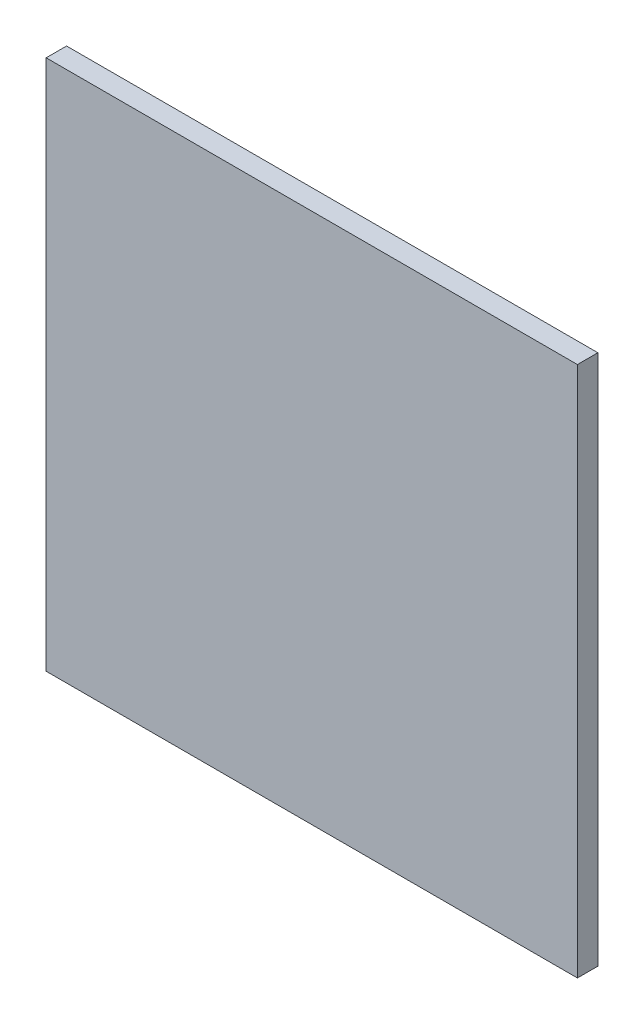
ISO-10303-21;
HEADER;
FILE_DESCRIPTION(('STEP AP214'),'2;1');
FILE_NAME('part.step','',(''),(''),'','','');
FILE_SCHEMA(('AUTOMOTIVE_DESIGN { 1 0 10303 214 1 1 1 1 }'));
ENDSEC;
DATA;
#1=APPLICATION_CONTEXT('core data for automotive mechanical design processes');
#2=APPLICATION_PROTOCOL_DEFINITION('international standard','automotive_design',2000,#1);
#3=PRODUCT_CONTEXT('',#1,'mechanical');
#4=PRODUCT('Part','Part','',(#3));
#5=PRODUCT_RELATED_PRODUCT_CATEGORY('part','',(#4));
#6=PRODUCT_DEFINITION_FORMATION('','',#4);
#7=PRODUCT_DEFINITION_CONTEXT('part definition',#1,'design');
#8=PRODUCT_DEFINITION('design','',#6,#7);
#9=PRODUCT_DEFINITION_SHAPE('','',#8);
#10=(LENGTH_UNIT() NAMED_UNIT(*) SI_UNIT(.MILLI.,.METRE.));
#11=(NAMED_UNIT(*) PLANE_ANGLE_UNIT() SI_UNIT($,.RADIAN.));
#12=(NAMED_UNIT(*) SI_UNIT($,.STERADIAN.) SOLID_ANGLE_UNIT());
#13=UNCERTAINTY_MEASURE_WITH_UNIT(LENGTH_MEASURE(1.E-05),#10,'distance_accuracy_value','');
#14=(GEOMETRIC_REPRESENTATION_CONTEXT(3) GLOBAL_UNCERTAINTY_ASSIGNED_CONTEXT((#13)) GLOBAL_UNIT_ASSIGNED_CONTEXT((#10,
#11,#12)) REPRESENTATION_CONTEXT('',''));
#15=CARTESIAN_POINT('',(0.,0.,0.));
#16=DIRECTION('',(0.,0.,1.));
#17=DIRECTION('',(1.,0.,0.));
#18=AXIS2_PLACEMENT_3D('',#15,#16,#17);
#19=CARTESIAN_POINT('',(-65.,-65.,5.));
#20=DIRECTION('',(1.,0.,0.));
#21=DIRECTION('',(0.,0.,-1.));
#22=AXIS2_PLACEMENT_3D('',#19,#20,#21);
#23=PLANE('',#22);
#24=DIRECTION('',(0.,-1.,0.));
#25=VECTOR('',#24,1.);
#26=CARTESIAN_POINT('',(-65.,-65.,0.));
#27=LINE('',#26,#25);
#28=CARTESIAN_POINT('',(-65.,65.,0.));
#29=VERTEX_POINT('',#28);
#30=CARTESIAN_POINT('',(-65.,-65.,0.));
#31=VERTEX_POINT('',#30);
#32=EDGE_CURVE('E98',#29,#31,#27,.T.);
#33=ORIENTED_EDGE('',*,*,#32,.T.);
#34=DIRECTION('',(0.,0.,-1.));
#35=VECTOR('',#34,1.);
#36=CARTESIAN_POINT('',(-65.,-65.,5.));
#37=LINE('',#36,#35);
#38=CARTESIAN_POINT('',(-65.,-65.,5.));
#39=VERTEX_POINT('',#38);
#40=EDGE_CURVE('E11',#39,#31,#37,.T.);
#41=ORIENTED_EDGE('',*,*,#40,.F.);
#42=DIRECTION('',(0.,-1.,0.));
#43=VECTOR('',#42,1.);
#44=CARTESIAN_POINT('',(-65.,-65.,5.));
#45=LINE('',#44,#43);
#46=CARTESIAN_POINT('',(-65.,65.,5.));
#47=VERTEX_POINT('',#46);
#48=EDGE_CURVE('E86',#47,#39,#45,.T.);
#49=ORIENTED_EDGE('',*,*,#48,.F.);
#50=DIRECTION('',(0.,0.,-1.));
#51=VECTOR('',#50,1.);
#52=CARTESIAN_POINT('',(-65.,65.,5.));
#53=LINE('',#52,#51);
#54=EDGE_CURVE('E94',#47,#29,#53,.T.);
#55=ORIENTED_EDGE('',*,*,#54,.T.);
#56=EDGE_LOOP('',(#33,#41,#49,#55));
#57=FACE_BOUND('',#56,.T.);
#58=ADVANCED_FACE('F35',(#57),#23,.F.);
#59=CARTESIAN_POINT('',(65.,-65.,5.));
#60=DIRECTION('',(0.,1.,0.));
#61=DIRECTION('',(-1.,0.,0.));
#62=AXIS2_PLACEMENT_3D('',#59,#60,#61);
#63=PLANE('',#62);
#64=DIRECTION('',(1.,0.,0.));
#65=VECTOR('',#64,1.);
#66=CARTESIAN_POINT('',(65.,-65.,0.));
#67=LINE('',#66,#65);
#68=CARTESIAN_POINT('',(65.,-65.,0.));
#69=VERTEX_POINT('',#68);
#70=EDGE_CURVE('E90',#31,#69,#67,.T.);
#71=ORIENTED_EDGE('',*,*,#70,.T.);
#72=DIRECTION('',(0.,0.,-1.));
#73=VECTOR('',#72,1.);
#74=CARTESIAN_POINT('',(65.,-65.,5.));
#75=LINE('',#74,#73);
#76=CARTESIAN_POINT('',(65.,-65.,5.));
#77=VERTEX_POINT('',#76);
#78=EDGE_CURVE('E43',#77,#69,#75,.T.);
#79=ORIENTED_EDGE('',*,*,#78,.F.);
#80=DIRECTION('',(1.,0.,0.));
#81=VECTOR('',#80,1.);
#82=CARTESIAN_POINT('',(65.,-65.,5.));
#83=LINE('',#82,#81);
#84=EDGE_CURVE('E81',#39,#77,#83,.T.);
#85=ORIENTED_EDGE('',*,*,#84,.F.);
#86=ORIENTED_EDGE('',*,*,#40,.T.);
#87=EDGE_LOOP('',(#71,#79,#85,#86));
#88=FACE_BOUND('',#87,.T.);
#89=ADVANCED_FACE('F89',(#88),#63,.F.);
#90=CARTESIAN_POINT('',(65.,-65.,5.));
#91=DIRECTION('',(-1.,0.,0.));
#92=DIRECTION('',(0.,0.,1.));
#93=AXIS2_PLACEMENT_3D('',#90,#91,#92);
#94=PLANE('',#93);
#95=DIRECTION('',(0.,1.,0.));
#96=VECTOR('',#95,1.);
#97=CARTESIAN_POINT('',(65.,-65.,0.));
#98=LINE('',#97,#96);
#99=CARTESIAN_POINT('',(65.,65.,0.));
#100=VERTEX_POINT('',#99);
#101=EDGE_CURVE('E68',#69,#100,#98,.T.);
#102=ORIENTED_EDGE('',*,*,#101,.T.);
#103=DIRECTION('',(0.,0.,-1.));
#104=VECTOR('',#103,1.);
#105=CARTESIAN_POINT('',(65.,65.,5.));
#106=LINE('',#105,#104);
#107=CARTESIAN_POINT('',(65.,65.,5.));
#108=VERTEX_POINT('',#107);
#109=EDGE_CURVE('E91',#108,#100,#106,.T.);
#110=ORIENTED_EDGE('',*,*,#109,.F.);
#111=DIRECTION('',(0.,1.,0.));
#112=VECTOR('',#111,1.);
#113=CARTESIAN_POINT('',(65.,-65.,5.));
#114=LINE('',#113,#112);
#115=EDGE_CURVE('E84',#77,#108,#114,.T.);
#116=ORIENTED_EDGE('',*,*,#115,.F.);
#117=ORIENTED_EDGE('',*,*,#78,.T.);
#118=EDGE_LOOP('',(#102,#110,#116,#117));
#119=FACE_BOUND('',#118,.T.);
#120=ADVANCED_FACE('F92',(#119),#94,.F.);
#121=CARTESIAN_POINT('',(65.,65.,5.));
#122=DIRECTION('',(0.,-1.,0.));
#123=DIRECTION('',(1.,0.,0.));
#124=AXIS2_PLACEMENT_3D('',#121,#122,#123);
#125=PLANE('',#124);
#126=DIRECTION('',(-1.,0.,0.));
#127=VECTOR('',#126,1.);
#128=CARTESIAN_POINT('',(65.,65.,0.));
#129=LINE('',#128,#127);
#130=EDGE_CURVE('E74',#100,#29,#129,.T.);
#131=ORIENTED_EDGE('',*,*,#130,.T.);
#132=ORIENTED_EDGE('',*,*,#54,.F.);
#133=DIRECTION('',(-1.,0.,0.));
#134=VECTOR('',#133,1.);
#135=CARTESIAN_POINT('',(65.,65.,5.));
#136=LINE('',#135,#134);
#137=EDGE_CURVE('E51',#108,#47,#136,.T.);
#138=ORIENTED_EDGE('',*,*,#137,.F.);
#139=ORIENTED_EDGE('',*,*,#109,.T.);
#140=EDGE_LOOP('',(#131,#132,#138,#139));
#141=FACE_BOUND('',#140,.T.);
#142=ADVANCED_FACE('F105',(#141),#125,.F.);
#143=CARTESIAN_POINT('',(0.,0.,5.));
#144=DIRECTION('',(0.,0.,1.));
#145=DIRECTION('',(1.,0.,0.));
#146=AXIS2_PLACEMENT_3D('',#143,#144,#145);
#147=PLANE('',#146);
#148=ORIENTED_EDGE('',*,*,#48,.T.);
#149=ORIENTED_EDGE('',*,*,#84,.T.);
#150=ORIENTED_EDGE('',*,*,#115,.T.);
#151=ORIENTED_EDGE('',*,*,#137,.T.);
#152=EDGE_LOOP('',(#148,#149,#150,#151));
#153=FACE_BOUND('',#152,.T.);
#154=ADVANCED_FACE('F82',(#153),#147,.T.);
#155=CARTESIAN_POINT('',(0.,0.,0.));
#156=DIRECTION('',(0.,0.,1.));
#157=DIRECTION('',(1.,0.,0.));
#158=AXIS2_PLACEMENT_3D('',#155,#156,#157);
#159=PLANE('',#158);
#160=ORIENTED_EDGE('',*,*,#32,.F.);
#161=ORIENTED_EDGE('',*,*,#130,.F.);
#162=ORIENTED_EDGE('',*,*,#101,.F.);
#163=ORIENTED_EDGE('',*,*,#70,.F.);
#164=EDGE_LOOP('',(#160,#161,#162,#163));
#165=FACE_BOUND('',#164,.T.);
#166=ADVANCED_FACE('F108',(#165),#159,.F.);
#167=CLOSED_SHELL('',(#58,#89,#120,#142,#154,#166));
#168=MANIFOLD_SOLID_BREP('B2',#167);
#169=ADVANCED_BREP_SHAPE_REPRESENTATION('',(#18,#168),#14);
#170=SHAPE_DEFINITION_REPRESENTATION(#9,#169);
ENDSEC;
END-ISO-10303-21;
